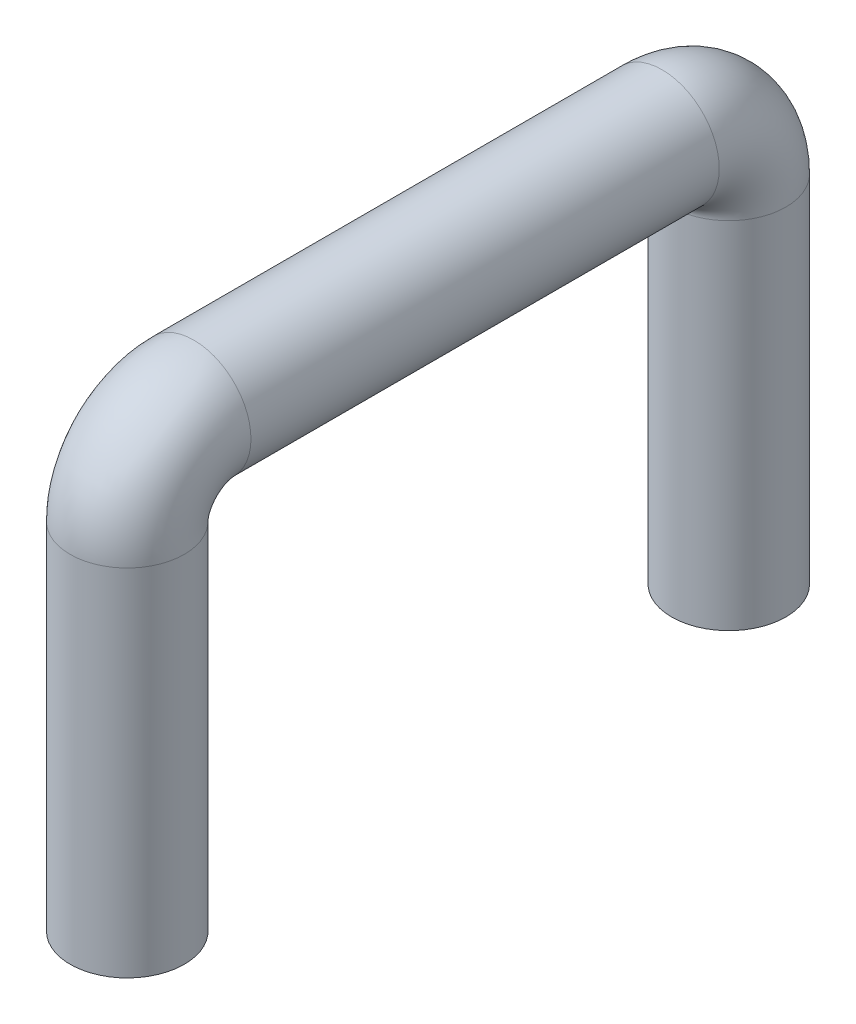
ISO-10303-21;
HEADER;
FILE_DESCRIPTION(('STEP AP214'),'2;1');
FILE_NAME('part.step','',(''),(''),'','','');
FILE_SCHEMA(('AUTOMOTIVE_DESIGN { 1 0 10303 214 1 1 1 1 }'));
ENDSEC;
DATA;
#1=APPLICATION_CONTEXT('core data for automotive mechanical design processes');
#2=APPLICATION_PROTOCOL_DEFINITION('international standard','automotive_design',2000,#1);
#3=PRODUCT_CONTEXT('',#1,'mechanical');
#4=PRODUCT('Part','Part','',(#3));
#5=PRODUCT_RELATED_PRODUCT_CATEGORY('part','',(#4));
#6=PRODUCT_DEFINITION_FORMATION('','',#4);
#7=PRODUCT_DEFINITION_CONTEXT('part definition',#1,'design');
#8=PRODUCT_DEFINITION('design','',#6,#7);
#9=PRODUCT_DEFINITION_SHAPE('','',#8);
#10=(LENGTH_UNIT() NAMED_UNIT(*) SI_UNIT(.MILLI.,.METRE.));
#11=(NAMED_UNIT(*) PLANE_ANGLE_UNIT() SI_UNIT($,.RADIAN.));
#12=(NAMED_UNIT(*) SI_UNIT($,.STERADIAN.) SOLID_ANGLE_UNIT());
#13=UNCERTAINTY_MEASURE_WITH_UNIT(LENGTH_MEASURE(1.E-05),#10,'distance_accuracy_value','');
#14=(GEOMETRIC_REPRESENTATION_CONTEXT(3) GLOBAL_UNCERTAINTY_ASSIGNED_CONTEXT((#13)) GLOBAL_UNIT_ASSIGNED_CONTEXT((#10,
#11,#12)) REPRESENTATION_CONTEXT('',''));
#15=CARTESIAN_POINT('',(0.,0.,0.));
#16=DIRECTION('',(0.,0.,1.));
#17=DIRECTION('',(1.,0.,0.));
#18=AXIS2_PLACEMENT_3D('',#15,#16,#17);
#19=CARTESIAN_POINT('',(0.,0.,15.8));
#20=DIRECTION('',(0.,-1.,0.));
#21=DIRECTION('',(0.,0.,-1.));
#22=AXIS2_PLACEMENT_3D('',#19,#20,#21);
#23=PLANE('',#22);
#24=CARTESIAN_POINT('',(0.,0.,15.8));
#25=DIRECTION('',(0.,-1.,0.));
#26=DIRECTION('',(0.,0.,-1.));
#27=AXIS2_PLACEMENT_3D('',#24,#25,#26);
#28=CIRCLE('',#27,3.);
#29=CARTESIAN_POINT('',(0.,0.,12.8));
#30=VERTEX_POINT('',#29);
#31=EDGE_CURVE('E17',#30,#30,#28,.F.);
#32=ORIENTED_EDGE('',*,*,#31,.F.);
#33=EDGE_LOOP('',(#32));
#34=FACE_BOUND('',#33,.T.);
#35=ADVANCED_FACE('F14',(#34),#23,.T.);
#36=CARTESIAN_POINT('',(0.,0.,-15.8));
#37=DIRECTION('',(0.,1.,0.));
#38=DIRECTION('',(0.,0.,1.));
#39=AXIS2_PLACEMENT_3D('',#36,#37,#38);
#40=PLANE('',#39);
#41=CARTESIAN_POINT('',(0.,0.,-15.8));
#42=DIRECTION('',(0.,1.,0.));
#43=DIRECTION('',(0.,0.,1.));
#44=AXIS2_PLACEMENT_3D('',#41,#42,#43);
#45=CIRCLE('',#44,3.);
#46=CARTESIAN_POINT('',(0.,0.,-12.8));
#47=VERTEX_POINT('',#46);
#48=EDGE_CURVE('E35',#47,#47,#45,.T.);
#49=ORIENTED_EDGE('',*,*,#48,.F.);
#50=EDGE_LOOP('',(#49));
#51=FACE_BOUND('',#50,.T.);
#52=ADVANCED_FACE('F46',(#51),#40,.F.);
#53=CARTESIAN_POINT('',(0.,18.65,15.8));
#54=DIRECTION('',(0.,-1.,0.));
#55=DIRECTION('',(0.,0.,-1.));
#56=AXIS2_PLACEMENT_3D('',#53,#54,#55);
#57=CYLINDRICAL_SURFACE('',#56,3.);
#58=ORIENTED_EDGE('',*,*,#31,.T.);
#59=EDGE_LOOP('',(#58));
#60=FACE_BOUND('',#59,.T.);
#61=CARTESIAN_POINT('',(0.,18.65,15.8));
#62=DIRECTION('',(0.,-1.,0.));
#63=DIRECTION('',(0.,0.,1.));
#64=AXIS2_PLACEMENT_3D('',#61,#62,#63);
#65=CIRCLE('',#64,3.);
#66=CARTESIAN_POINT('',(0.,18.65,18.8));
#67=VERTEX_POINT('',#66);
#68=EDGE_CURVE('E33',#67,#67,#65,.F.);
#69=ORIENTED_EDGE('',*,*,#68,.F.);
#70=EDGE_LOOP('',(#69));
#71=FACE_BOUND('',#70,.T.);
#72=ADVANCED_FACE('F42',(#60,#71),#57,.T.);
#73=CARTESIAN_POINT('',(0.,0.,-15.8));
#74=DIRECTION('',(0.,1.,0.));
#75=DIRECTION('',(0.,0.,1.));
#76=AXIS2_PLACEMENT_3D('',#73,#74,#75);
#77=CYLINDRICAL_SURFACE('',#76,3.);
#78=CARTESIAN_POINT('',(0.,18.65,-15.8));
#79=DIRECTION('',(0.,1.,0.));
#80=DIRECTION('',(0.,0.,-1.));
#81=AXIS2_PLACEMENT_3D('',#78,#79,#80);
#82=CIRCLE('',#81,3.);
#83=CARTESIAN_POINT('',(0.,18.65,-18.8));
#84=VERTEX_POINT('',#83);
#85=EDGE_CURVE('E26',#84,#84,#82,.T.);
#86=ORIENTED_EDGE('',*,*,#85,.F.);
#87=EDGE_LOOP('',(#86));
#88=FACE_BOUND('',#87,.T.);
#89=ORIENTED_EDGE('',*,*,#48,.T.);
#90=EDGE_LOOP('',(#89));
#91=FACE_BOUND('',#90,.T.);
#92=ADVANCED_FACE('F69',(#88,#91),#77,.T.);
#93=CARTESIAN_POINT('',(0.,18.65,12.3));
#94=DIRECTION('',(1.,0.,0.));
#95=DIRECTION('',(0.,-1.,0.));
#96=AXIS2_PLACEMENT_3D('',#93,#94,#95);
#97=TOROIDAL_SURFACE('',#96,3.5,3.);
#98=ORIENTED_EDGE('',*,*,#68,.T.);
#99=EDGE_LOOP('',(#98));
#100=FACE_BOUND('',#99,.T.);
#101=CARTESIAN_POINT('',(0.,22.15,12.3));
#102=DIRECTION('',(0.,0.,1.));
#103=DIRECTION('',(1.,0.,0.));
#104=AXIS2_PLACEMENT_3D('',#101,#102,#103);
#105=CIRCLE('',#104,3.);
#106=CARTESIAN_POINT('',(3.,22.15,12.3));
#107=VERTEX_POINT('',#106);
#108=EDGE_CURVE('E21',#107,#107,#105,.F.);
#109=ORIENTED_EDGE('',*,*,#108,.F.);
#110=EDGE_LOOP('',(#109));
#111=FACE_BOUND('',#110,.T.);
#112=ADVANCED_FACE('F60',(#100,#111),#97,.T.);
#113=CARTESIAN_POINT('',(0.,18.65,-12.3));
#114=DIRECTION('',(1.,0.,0.));
#115=DIRECTION('',(0.,0.,1.));
#116=AXIS2_PLACEMENT_3D('',#113,#114,#115);
#117=TOROIDAL_SURFACE('',#116,3.5,3.);
#118=CARTESIAN_POINT('',(0.,22.15,-12.3));
#119=DIRECTION('',(0.,0.,1.));
#120=DIRECTION('',(1.,0.,0.));
#121=AXIS2_PLACEMENT_3D('',#118,#119,#120);
#122=CIRCLE('',#121,3.);
#123=CARTESIAN_POINT('',(3.,22.15,-12.3));
#124=VERTEX_POINT('',#123);
#125=EDGE_CURVE('E10',#124,#124,#122,.T.);
#126=ORIENTED_EDGE('',*,*,#125,.F.);
#127=EDGE_LOOP('',(#126));
#128=FACE_BOUND('',#127,.T.);
#129=ORIENTED_EDGE('',*,*,#85,.T.);
#130=EDGE_LOOP('',(#129));
#131=FACE_BOUND('',#130,.T.);
#132=ADVANCED_FACE('F54',(#128,#131),#117,.T.);
#133=CARTESIAN_POINT('',(0.,22.15,-12.3));
#134=DIRECTION('',(0.,0.,1.));
#135=DIRECTION('',(1.,0.,0.));
#136=AXIS2_PLACEMENT_3D('',#133,#134,#135);
#137=CYLINDRICAL_SURFACE('',#136,3.);
#138=ORIENTED_EDGE('',*,*,#108,.T.);
#139=EDGE_LOOP('',(#138));
#140=FACE_BOUND('',#139,.T.);
#141=ORIENTED_EDGE('',*,*,#125,.T.);
#142=EDGE_LOOP('',(#141));
#143=FACE_BOUND('',#142,.T.);
#144=ADVANCED_FACE('F52',(#140,#143),#137,.T.);
#145=CLOSED_SHELL('',(#35,#52,#72,#92,#112,#132,#144));
#146=MANIFOLD_SOLID_BREP('B1',#145);
#147=ADVANCED_BREP_SHAPE_REPRESENTATION('',(#18,#146),#14);
#148=SHAPE_DEFINITION_REPRESENTATION(#9,#147);
ENDSEC;
END-ISO-10303-21;
